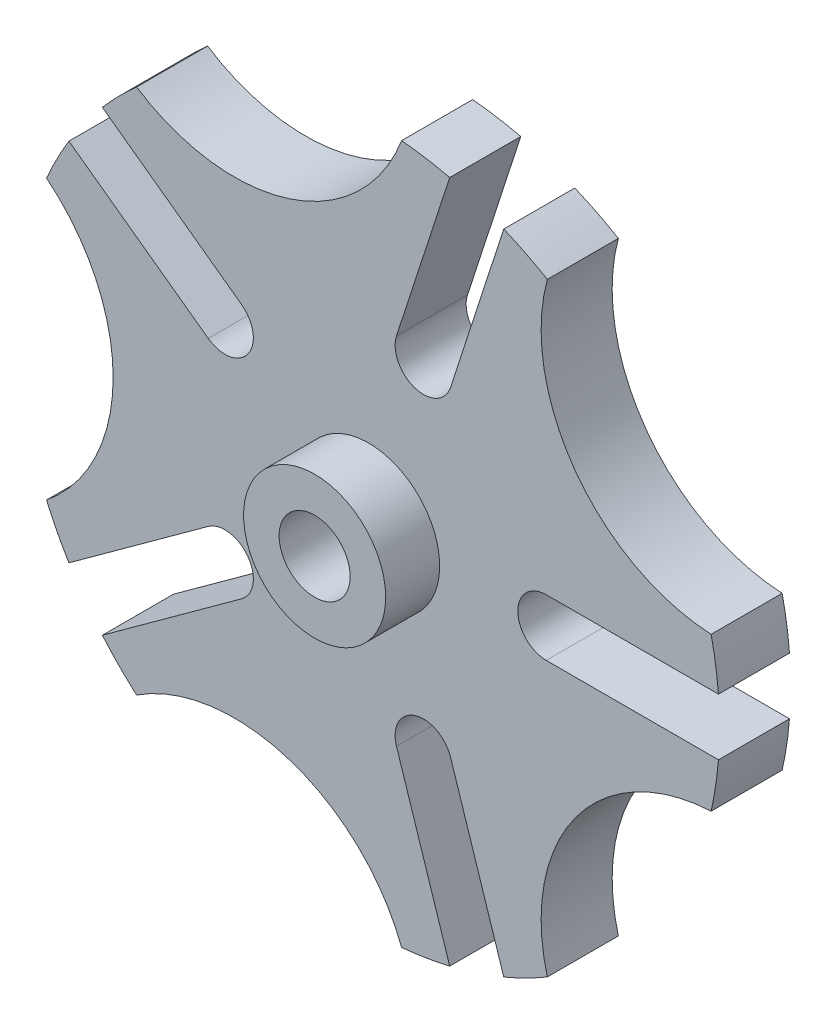
ISO-10303-21;
HEADER;
FILE_DESCRIPTION(('STEP AP214'),'2;1');
FILE_NAME('part.step','',(''),(''),'','','');
FILE_SCHEMA(('AUTOMOTIVE_DESIGN { 1 0 10303 214 1 1 1 1 }'));
ENDSEC;
DATA;
#1=APPLICATION_CONTEXT('core data for automotive mechanical design processes');
#2=APPLICATION_PROTOCOL_DEFINITION('international standard','automotive_design',2000,#1);
#3=PRODUCT_CONTEXT('',#1,'mechanical');
#4=PRODUCT('Part','Part','',(#3));
#5=PRODUCT_RELATED_PRODUCT_CATEGORY('part','',(#4));
#6=PRODUCT_DEFINITION_FORMATION('','',#4);
#7=PRODUCT_DEFINITION_CONTEXT('part definition',#1,'design');
#8=PRODUCT_DEFINITION('design','',#6,#7);
#9=PRODUCT_DEFINITION_SHAPE('','',#8);
#10=(LENGTH_UNIT() NAMED_UNIT(*) SI_UNIT(.MILLI.,.METRE.));
#11=(NAMED_UNIT(*) PLANE_ANGLE_UNIT() SI_UNIT($,.RADIAN.));
#12=(NAMED_UNIT(*) SI_UNIT($,.STERADIAN.) SOLID_ANGLE_UNIT());
#13=UNCERTAINTY_MEASURE_WITH_UNIT(LENGTH_MEASURE(1.E-05),#10,'distance_accuracy_value','');
#14=(GEOMETRIC_REPRESENTATION_CONTEXT(3) GLOBAL_UNCERTAINTY_ASSIGNED_CONTEXT((#13)) GLOBAL_UNIT_ASSIGNED_CONTEXT((#10,
#11,#12)) REPRESENTATION_CONTEXT('',''));
#15=CARTESIAN_POINT('',(0.,0.,0.));
#16=DIRECTION('',(0.,0.,1.));
#17=DIRECTION('',(1.,0.,0.));
#18=AXIS2_PLACEMENT_3D('',#15,#16,#17);
#19=CARTESIAN_POINT('',(15.875,0.,6.35));
#20=DIRECTION('',(0.,0.,-1.));
#21=DIRECTION('',(-1.,0.,0.));
#22=AXIS2_PLACEMENT_3D('',#19,#20,#21);
#23=CYLINDRICAL_SURFACE('',#22,2.54);
#24=CARTESIAN_POINT('',(15.875,0.,0.));
#25=DIRECTION('',(0.,0.,-1.));
#26=DIRECTION('',(1.,0.,0.));
#27=AXIS2_PLACEMENT_3D('',#24,#25,#26);
#28=CIRCLE('',#27,2.54);
#29=CARTESIAN_POINT('',(15.875,-2.53999999999989,0.));
#30=VERTEX_POINT('',#29);
#31=CARTESIAN_POINT('',(15.875,2.54,0.));
#32=VERTEX_POINT('',#31);
#33=EDGE_CURVE('E135',#30,#32,#28,.T.);
#34=ORIENTED_EDGE('',*,*,#33,.T.);
#35=DIRECTION('',(0.,0.,-1.));
#36=VECTOR('',#35,1.);
#37=CARTESIAN_POINT('',(15.875,2.54,6.35));
#38=LINE('',#37,#36);
#39=CARTESIAN_POINT('',(15.875,2.54,6.35));
#40=VERTEX_POINT('',#39);
#41=EDGE_CURVE('E46',#40,#32,#38,.T.);
#42=ORIENTED_EDGE('',*,*,#41,.F.);
#43=CARTESIAN_POINT('',(15.875,0.,6.35));
#44=DIRECTION('',(0.,0.,-1.));
#45=DIRECTION('',(1.,0.,0.));
#46=AXIS2_PLACEMENT_3D('',#43,#44,#45);
#47=CIRCLE('',#46,2.54);
#48=CARTESIAN_POINT('',(15.875,-2.53999999999989,6.35));
#49=VERTEX_POINT('',#48);
#50=EDGE_CURVE('E98',#49,#40,#47,.T.);
#51=ORIENTED_EDGE('',*,*,#50,.F.);
#52=DIRECTION('',(0.,0.,-1.));
#53=VECTOR('',#52,1.);
#54=CARTESIAN_POINT('',(15.875,-2.53999999999989,6.35));
#55=LINE('',#54,#53);
#56=EDGE_CURVE('E348',#49,#30,#55,.T.);
#57=ORIENTED_EDGE('',*,*,#56,.T.);
#58=EDGE_LOOP('',(#34,#42,#51,#57));
#59=FACE_BOUND('',#58,.T.);
#60=ADVANCED_FACE('F43',(#59),#23,.F.);
#61=CARTESIAN_POINT('',(15.875,2.54,6.35));
#62=DIRECTION('',(0.,1.,0.));
#63=DIRECTION('',(0.,0.,1.));
#64=AXIS2_PLACEMENT_3D('',#61,#62,#63);
#65=PLANE('',#64);
#66=DIRECTION('',(1.,0.,0.));
#67=VECTOR('',#66,1.);
#68=CARTESIAN_POINT('',(15.875,2.54,0.));
#69=LINE('',#68,#67);
#70=CARTESIAN_POINT('',(31.2659968815965,2.54,0.));
#71=VERTEX_POINT('',#70);
#72=EDGE_CURVE('E137',#32,#71,#69,.T.);
#73=ORIENTED_EDGE('',*,*,#72,.T.);
#74=DIRECTION('',(0.,0.,-1.));
#75=VECTOR('',#74,1.);
#76=CARTESIAN_POINT('',(31.2659968815965,2.54,6.35));
#77=LINE('',#76,#75);
#78=CARTESIAN_POINT('',(31.2659968815965,2.54,6.35));
#79=VERTEX_POINT('',#78);
#80=EDGE_CURVE('E150',#79,#71,#77,.T.);
#81=ORIENTED_EDGE('',*,*,#80,.F.);
#82=DIRECTION('',(1.,0.,0.));
#83=VECTOR('',#82,1.);
#84=CARTESIAN_POINT('',(15.875,2.54,6.35));
#85=LINE('',#84,#83);
#86=EDGE_CURVE('E160',#40,#79,#85,.T.);
#87=ORIENTED_EDGE('',*,*,#86,.F.);
#88=ORIENTED_EDGE('',*,*,#41,.T.);
#89=EDGE_LOOP('',(#73,#81,#87,#88));
#90=FACE_BOUND('',#89,.T.);
#91=ADVANCED_FACE('F159',(#90),#65,.F.);
#92=CARTESIAN_POINT('',(0.,0.,6.35));
#93=DIRECTION('',(0.,0.,-1.));
#94=DIRECTION('',(-1.,0.,0.));
#95=AXIS2_PLACEMENT_3D('',#92,#93,#94);
#96=CYLINDRICAL_SURFACE('',#95,31.369);
#97=CARTESIAN_POINT('',(0.,0.,0.));
#98=DIRECTION('',(0.,0.,1.));
#99=DIRECTION('',(1.,0.,0.));
#100=AXIS2_PLACEMENT_3D('',#97,#98,#99);
#101=CIRCLE('',#100,31.369);
#102=CARTESIAN_POINT('',(30.6128649977918,6.8459227009201,0.));
#103=VERTEX_POINT('',#102);
#104=EDGE_CURVE('E140',#71,#103,#101,.T.);
#105=ORIENTED_EDGE('',*,*,#104,.T.);
#106=DIRECTION('',(0.,0.,-1.));
#107=VECTOR('',#106,1.);
#108=CARTESIAN_POINT('',(30.6128649977918,6.8459227009201,6.35));
#109=LINE('',#108,#107);
#110=CARTESIAN_POINT('',(30.6128649977918,6.8459227009201,6.35));
#111=VERTEX_POINT('',#110);
#112=EDGE_CURVE('E124',#111,#103,#109,.T.);
#113=ORIENTED_EDGE('',*,*,#112,.F.);
#114=CARTESIAN_POINT('',(0.,0.,6.35));
#115=DIRECTION('',(0.,0.,1.));
#116=DIRECTION('',(1.,0.,0.));
#117=AXIS2_PLACEMENT_3D('',#114,#115,#116);
#118=CIRCLE('',#117,31.369);
#119=EDGE_CURVE('E115',#79,#111,#118,.T.);
#120=ORIENTED_EDGE('',*,*,#119,.F.);
#121=ORIENTED_EDGE('',*,*,#80,.T.);
#122=EDGE_LOOP('',(#105,#113,#120,#121));
#123=FACE_BOUND('',#122,.T.);
#124=ADVANCED_FACE('F168',(#123),#96,.T.);
#125=CARTESIAN_POINT('',(31.4194694037421,22.8275807291818,6.35));
#126=DIRECTION('',(0.,0.,-1.));
#127=DIRECTION('',(-1.,0.,0.));
#128=AXIS2_PLACEMENT_3D('',#125,#126,#127);
#129=CYLINDRICAL_SURFACE('',#128,16.002);
#130=CARTESIAN_POINT('',(31.4194694037421,22.8275807291818,0.));
#131=DIRECTION('',(0.,0.,-1.));
#132=DIRECTION('',(1.,0.,0.));
#133=AXIS2_PLACEMENT_3D('',#130,#131,#132);
#134=CIRCLE('',#133,16.002);
#135=CARTESIAN_POINT('',(15.9707549255868,26.9990582818521,0.));
#136=VERTEX_POINT('',#135);
#137=EDGE_CURVE('E123',#103,#136,#134,.T.);
#138=ORIENTED_EDGE('',*,*,#137,.T.);
#139=DIRECTION('',(0.,0.,-1.));
#140=VECTOR('',#139,1.);
#141=CARTESIAN_POINT('',(15.9707549255868,26.9990582818521,6.35));
#142=LINE('',#141,#140);
#143=CARTESIAN_POINT('',(15.9707549255868,26.9990582818521,6.35));
#144=VERTEX_POINT('',#143);
#145=EDGE_CURVE('E120',#144,#136,#142,.T.);
#146=ORIENTED_EDGE('',*,*,#145,.F.);
#147=CARTESIAN_POINT('',(31.4194694037421,22.8275807291818,6.35));
#148=DIRECTION('',(0.,0.,-1.));
#149=DIRECTION('',(1.,0.,0.));
#150=AXIS2_PLACEMENT_3D('',#147,#148,#149);
#151=CIRCLE('',#150,16.002);
#152=EDGE_CURVE('E109',#111,#144,#151,.T.);
#153=ORIENTED_EDGE('',*,*,#152,.F.);
#154=ORIENTED_EDGE('',*,*,#112,.T.);
#155=EDGE_LOOP('',(#138,#146,#153,#154));
#156=FACE_BOUND('',#155,.T.);
#157=ADVANCED_FACE('F121',(#156),#129,.F.);
#158=CARTESIAN_POINT('',(0.,0.,6.35));
#159=DIRECTION('',(0.,0.,-1.));
#160=DIRECTION('',(-1.,0.,0.));
#161=AXIS2_PLACEMENT_3D('',#158,#159,#160);
#162=CYLINDRICAL_SURFACE('',#161,31.369);
#163=CARTESIAN_POINT('',(0.,0.,0.));
#164=DIRECTION('',(0.,0.,1.));
#165=DIRECTION('',(1.,0.,0.));
#166=AXIS2_PLACEMENT_3D('',#163,#164,#165);
#167=CIRCLE('',#166,31.369);
#168=CARTESIAN_POINT('',(12.0774079338772,28.9508269069938,0.));
#169=VERTEX_POINT('',#168);
#170=EDGE_CURVE('E84',#136,#169,#167,.T.);
#171=ORIENTED_EDGE('',*,*,#170,.T.);
#172=DIRECTION('',(0.,0.,-1.));
#173=VECTOR('',#172,1.);
#174=CARTESIAN_POINT('',(12.0774079338772,28.9508269069938,6.35));
#175=LINE('',#174,#173);
#176=CARTESIAN_POINT('',(12.0774079338772,28.9508269069938,6.35));
#177=VERTEX_POINT('',#176);
#178=EDGE_CURVE('E125',#177,#169,#175,.T.);
#179=ORIENTED_EDGE('',*,*,#178,.F.);
#180=CARTESIAN_POINT('',(0.,0.,6.35));
#181=DIRECTION('',(0.,0.,1.));
#182=DIRECTION('',(1.,0.,0.));
#183=AXIS2_PLACEMENT_3D('',#180,#181,#182);
#184=CIRCLE('',#183,31.369);
#185=EDGE_CURVE('E113',#144,#177,#184,.T.);
#186=ORIENTED_EDGE('',*,*,#185,.F.);
#187=ORIENTED_EDGE('',*,*,#145,.T.);
#188=EDGE_LOOP('',(#171,#179,#186,#187));
#189=FACE_BOUND('',#188,.T.);
#190=ADVANCED_FACE('F127',(#189),#162,.T.);
#191=CARTESIAN_POINT('',(7.32132833709204,14.3131190304732,6.35));
#192=DIRECTION('',(0.951056516295152,-0.309016994374951,0.));
#193=DIRECTION('',(0.309016994374951,0.951056516295153,0.));
#194=AXIS2_PLACEMENT_3D('',#191,#192,#193);
#195=PLANE('',#194);
#196=DIRECTION('',(-0.309016994374951,-0.951056516295152,0.));
#197=VECTOR('',#196,1.);
#198=CARTESIAN_POINT('',(7.32132833709204,14.3131190304732,0.));
#199=LINE('',#198,#197);
#200=CARTESIAN_POINT('',(7.32132833709204,14.3131190304732,0.));
#201=VERTEX_POINT('',#200);
#202=EDGE_CURVE('E90',#169,#201,#199,.T.);
#203=ORIENTED_EDGE('',*,*,#202,.T.);
#204=DIRECTION('',(0.,0.,-1.));
#205=VECTOR('',#204,1.);
#206=CARTESIAN_POINT('',(7.32132833709204,14.3131190304732,6.35));
#207=LINE('',#206,#205);
#208=CARTESIAN_POINT('',(7.32132833709204,14.3131190304732,6.35));
#209=VERTEX_POINT('',#208);
#210=EDGE_CURVE('E134',#209,#201,#207,.T.);
#211=ORIENTED_EDGE('',*,*,#210,.F.);
#212=DIRECTION('',(-0.309016994374951,-0.951056516295152,0.));
#213=VECTOR('',#212,1.);
#214=CARTESIAN_POINT('',(7.32132833709204,14.3131190304732,6.35));
#215=LINE('',#214,#213);
#216=EDGE_CURVE('E60',#177,#209,#215,.T.);
#217=ORIENTED_EDGE('',*,*,#216,.F.);
#218=ORIENTED_EDGE('',*,*,#178,.T.);
#219=EDGE_LOOP('',(#203,#211,#217,#218));
#220=FACE_BOUND('',#219,.T.);
#221=ADVANCED_FACE('F414',(#220),#195,.F.);
#222=CARTESIAN_POINT('',(4.90564478570235,15.0980221961855,6.35));
#223=DIRECTION('',(0.,0.,-1.));
#224=DIRECTION('',(-1.,0.,0.));
#225=AXIS2_PLACEMENT_3D('',#222,#223,#224);
#226=CYLINDRICAL_SURFACE('',#225,2.54);
#227=CARTESIAN_POINT('',(4.90564478570235,15.0980221961855,0.));
#228=DIRECTION('',(0.,0.,-1.));
#229=DIRECTION('',(1.,0.,0.));
#230=AXIS2_PLACEMENT_3D('',#227,#228,#229);
#231=CIRCLE('',#230,2.54);
#232=CARTESIAN_POINT('',(2.48996123431256,15.8829253618979,0.));
#233=VERTEX_POINT('',#232);
#234=EDGE_CURVE('E145',#201,#233,#231,.T.);
#235=ORIENTED_EDGE('',*,*,#234,.T.);
#236=DIRECTION('',(0.,0.,-1.));
#237=VECTOR('',#236,1.);
#238=CARTESIAN_POINT('',(2.48996123431256,15.8829253618979,6.35));
#239=LINE('',#238,#237);
#240=CARTESIAN_POINT('',(2.48996123431256,15.8829253618979,6.35));
#241=VERTEX_POINT('',#240);
#242=EDGE_CURVE('E138',#241,#233,#239,.T.);
#243=ORIENTED_EDGE('',*,*,#242,.F.);
#244=CARTESIAN_POINT('',(4.90564478570235,15.0980221961855,6.35));
#245=DIRECTION('',(0.,0.,-1.));
#246=DIRECTION('',(1.,0.,0.));
#247=AXIS2_PLACEMENT_3D('',#244,#245,#246);
#248=CIRCLE('',#247,2.54);
#249=EDGE_CURVE('E129',#209,#241,#248,.T.);
#250=ORIENTED_EDGE('',*,*,#249,.F.);
#251=ORIENTED_EDGE('',*,*,#210,.T.);
#252=EDGE_LOOP('',(#235,#243,#250,#251));
#253=FACE_BOUND('',#252,.T.);
#254=ADVANCED_FACE('F405',(#253),#226,.F.);
#255=CARTESIAN_POINT('',(15.875,0.,6.35));
#256=DIRECTION('',(0.,0.,1.));
#257=DIRECTION('',(1.,0.,0.));
#258=AXIS2_PLACEMENT_3D('',#255,#256,#257);
#259=PLANE('',#258);
#260=CARTESIAN_POINT('',(0.,0.,6.35));
#261=DIRECTION('',(0.,0.,1.));
#262=DIRECTION('',(1.,0.,0.));
#263=AXIS2_PLACEMENT_3D('',#260,#261,#262);
#264=CIRCLE('',#263,6.35);
#265=CARTESIAN_POINT('',(6.35,0.,6.35));
#266=VERTEX_POINT('',#265);
#267=EDGE_CURVE('E11',#266,#266,#264,.T.);
#268=ORIENTED_EDGE('',*,*,#267,.F.);
#269=EDGE_LOOP('',(#268));
#270=FACE_BOUND('',#269,.T.);
#271=ORIENTED_EDGE('',*,*,#249,.T.);
#272=DIRECTION('',(0.309016994374945,0.951056516295155,0.));
#273=VECTOR('',#272,1.);
#274=CARTESIAN_POINT('',(2.48996123431256,15.8829253618979,6.35));
#275=LINE('',#274,#273);
#276=CARTESIAN_POINT('',(7.24604083109764,30.5206332384187,6.35));
#277=VERTEX_POINT('',#276);
#278=EDGE_CURVE('E193',#241,#277,#275,.T.);
#279=ORIENTED_EDGE('',*,*,#278,.T.);
#280=CARTESIAN_POINT('',(0.,0.,6.35));
#281=DIRECTION('',(0.,0.,1.));
#282=DIRECTION('',(0.309016994374945,0.951056516295155,0.));
#283=AXIS2_PLACEMENT_3D('',#280,#281,#282);
#284=CIRCLE('',#283,31.369);
#285=CARTESIAN_POINT('',(2.94903613606059,31.2300711953753,6.35));
#286=VERTEX_POINT('',#285);
#287=EDGE_CURVE('E221',#277,#286,#284,.T.);
#288=ORIENTED_EDGE('',*,*,#287,.T.);
#289=CARTESIAN_POINT('',(-12.0011694037421,36.9358015007484,6.35));
#290=DIRECTION('',(0.,0.,-1.));
#291=DIRECTION('',(0.309016994374945,0.951056516295155,0.));
#292=AXIS2_PLACEMENT_3D('',#289,#290,#291);
#293=CIRCLE('',#292,16.002);
#294=CARTESIAN_POINT('',(-20.7423956277844,23.5322583833441,6.35));
#295=VERTEX_POINT('',#294);
#296=EDGE_CURVE('E218',#286,#295,#293,.T.);
#297=ORIENTED_EDGE('',*,*,#296,.T.);
#298=CARTESIAN_POINT('',(0.,0.,6.35));
#299=DIRECTION('',(0.,0.,1.));
#300=DIRECTION('',(0.309016994374945,0.951056516295155,0.));
#301=AXIS2_PLACEMENT_3D('',#298,#299,#300);
#302=CIRCLE('',#301,31.369);
#303=CARTESIAN_POINT('',(-23.8017482824627,20.4325950309373,6.35));
#304=VERTEX_POINT('',#303);
#305=EDGE_CURVE('E215',#295,#304,#302,.T.);
#306=ORIENTED_EDGE('',*,*,#305,.T.);
#307=DIRECTION('',(0.809016994374947,-0.587785252292474,0.));
#308=VECTOR('',#307,1.);
#309=CARTESIAN_POINT('',(-11.3501702448794,11.3859940458554,6.35));
#310=LINE('',#309,#308);
#311=CARTESIAN_POINT('',(-11.3501702448794,11.3859940458554,6.35));
#312=VERTEX_POINT('',#311);
#313=EDGE_CURVE('E212',#304,#312,#310,.T.);
#314=ORIENTED_EDGE('',*,*,#313,.T.);
#315=CARTESIAN_POINT('',(-12.8431447857023,9.33109088014303,6.35));
#316=DIRECTION('',(0.,0.,-1.));
#317=DIRECTION('',(0.309016994374945,0.951056516295155,0.));
#318=AXIS2_PLACEMENT_3D('',#315,#316,#317);
#319=CIRCLE('',#318,2.54);
#320=CARTESIAN_POINT('',(-14.3361193265252,7.27618771443056,6.35));
#321=VERTEX_POINT('',#320);
#322=EDGE_CURVE('E189',#312,#321,#319,.T.);
#323=ORIENTED_EDGE('',*,*,#322,.T.);
#324=DIRECTION('',(-0.809016994374951,0.587785252292468,0.));
#325=VECTOR('',#324,1.);
#326=CARTESIAN_POINT('',(-14.3361193265252,7.27618771443056,6.35));
#327=LINE('',#326,#325);
#328=CARTESIAN_POINT('',(-26.7876973641086,16.3227886995123,6.35));
#329=VERTEX_POINT('',#328);
#330=EDGE_CURVE('E247',#321,#329,#327,.T.);
#331=ORIENTED_EDGE('',*,*,#330,.T.);
#332=CARTESIAN_POINT('',(0.,0.,6.35));
#333=DIRECTION('',(0.,0.,1.));
#334=DIRECTION('',(-0.809016994374951,0.587785252292469,0.));
#335=AXIS2_PLACEMENT_3D('',#332,#333,#334);
#336=CIRCLE('',#335,31.369);
#337=CARTESIAN_POINT('',(-28.7902604316547,12.4553227689007,6.35));
#338=VERTEX_POINT('',#337);
#339=EDGE_CURVE('E275',#329,#338,#336,.T.);
#340=ORIENTED_EDGE('',*,*,#339,.T.);
#341=CARTESIAN_POINT('',(-38.8366,-1.31838984174237E-13,6.35));
#342=DIRECTION('',(0.,0.,-1.));
#343=DIRECTION('',(-0.809016994374951,0.587785252292469,0.));
#344=AXIS2_PLACEMENT_3D('',#341,#342,#343);
#345=CIRCLE('',#344,16.002);
#346=CARTESIAN_POINT('',(-28.7902604316546,-12.4553227689009,6.35));
#347=VERTEX_POINT('',#346);
#348=EDGE_CURVE('E272',#338,#347,#345,.T.);
#349=ORIENTED_EDGE('',*,*,#348,.T.);
#350=CARTESIAN_POINT('',(0.,0.,6.35));
#351=DIRECTION('',(0.,0.,1.));
#352=DIRECTION('',(-0.809016994374951,0.587785252292469,0.));
#353=AXIS2_PLACEMENT_3D('',#350,#351,#352);
#354=CIRCLE('',#353,31.369);
#355=CARTESIAN_POINT('',(-26.7876973641085,-16.3227886995125,6.35));
#356=VERTEX_POINT('',#355);
#357=EDGE_CURVE('E269',#347,#356,#354,.T.);
#358=ORIENTED_EDGE('',*,*,#357,.T.);
#359=DIRECTION('',(0.809016994374946,0.587785252292474,0.));
#360=VECTOR('',#359,1.);
#361=CARTESIAN_POINT('',(-14.3361193265252,-7.27618771443066,6.35));
#362=LINE('',#361,#360);
#363=CARTESIAN_POINT('',(-14.3361193265252,-7.27618771443067,6.35));
#364=VERTEX_POINT('',#363);
#365=EDGE_CURVE('E266',#356,#364,#362,.T.);
#366=ORIENTED_EDGE('',*,*,#365,.T.);
#367=CARTESIAN_POINT('',(-12.8431447857023,-9.33109088014303,6.35));
#368=DIRECTION('',(0.,0.,-1.));
#369=DIRECTION('',(-0.809016994374951,0.587785252292469,0.));
#370=AXIS2_PLACEMENT_3D('',#367,#368,#369);
#371=CIRCLE('',#370,2.54);
#372=CARTESIAN_POINT('',(-11.3501702448793,-11.3859940458555,6.35));
#373=VERTEX_POINT('',#372);
#374=EDGE_CURVE('E243',#364,#373,#371,.T.);
#375=ORIENTED_EDGE('',*,*,#374,.T.);
#376=DIRECTION('',(-0.809016994374942,-0.58778525229248,0.));
#377=VECTOR('',#376,1.);
#378=CARTESIAN_POINT('',(-11.3501702448793,-11.3859940458555,6.35));
#379=LINE('',#378,#377);
#380=CARTESIAN_POINT('',(-23.8017482824626,-20.4325950309374,6.35));
#381=VERTEX_POINT('',#380);
#382=EDGE_CURVE('E301',#373,#381,#379,.T.);
#383=ORIENTED_EDGE('',*,*,#382,.T.);
#384=CARTESIAN_POINT('',(0.,0.,6.35));
#385=DIRECTION('',(0.,0.,1.));
#386=DIRECTION('',(-0.809016994374942,-0.58778525229248,0.));
#387=AXIS2_PLACEMENT_3D('',#384,#385,#386);
#388=CIRCLE('',#387,31.369);
#389=CARTESIAN_POINT('',(-20.7423956277843,-23.5322583833443,6.35));
#390=VERTEX_POINT('',#389);
#391=EDGE_CURVE('E329',#381,#390,#388,.T.);
#392=ORIENTED_EDGE('',*,*,#391,.T.);
#393=CARTESIAN_POINT('',(-12.0011694037418,-36.9358015007484,6.35));
#394=DIRECTION('',(0.,0.,-1.));
#395=DIRECTION('',(-0.809016994374942,-0.58778525229248,0.));
#396=AXIS2_PLACEMENT_3D('',#393,#394,#395);
#397=CIRCLE('',#396,16.002);
#398=CARTESIAN_POINT('',(2.94903613606081,-31.2300711953753,6.35));
#399=VERTEX_POINT('',#398);
#400=EDGE_CURVE('E326',#390,#399,#397,.T.);
#401=ORIENTED_EDGE('',*,*,#400,.T.);
#402=CARTESIAN_POINT('',(0.,0.,6.35));
#403=DIRECTION('',(0.,0.,1.));
#404=DIRECTION('',(-0.809016994374942,-0.58778525229248,0.));
#405=AXIS2_PLACEMENT_3D('',#402,#403,#404);
#406=CIRCLE('',#405,31.369);
#407=CARTESIAN_POINT('',(7.24604083109787,-30.5206332384186,6.35));
#408=VERTEX_POINT('',#407);
#409=EDGE_CURVE('E323',#399,#408,#406,.T.);
#410=ORIENTED_EDGE('',*,*,#409,.T.);
#411=DIRECTION('',(-0.309016994374952,0.951056516295152,0.));
#412=VECTOR('',#411,1.);
#413=CARTESIAN_POINT('',(2.48996123431267,-15.8829253618979,6.35));
#414=LINE('',#413,#412);
#415=CARTESIAN_POINT('',(2.48996123431267,-15.8829253618979,6.35));
#416=VERTEX_POINT('',#415);
#417=EDGE_CURVE('E320',#408,#416,#414,.T.);
#418=ORIENTED_EDGE('',*,*,#417,.T.);
#419=CARTESIAN_POINT('',(4.90564478570236,-15.0980221961855,6.35));
#420=DIRECTION('',(0.,0.,-1.));
#421=DIRECTION('',(-0.809016994374942,-0.58778525229248,0.));
#422=AXIS2_PLACEMENT_3D('',#419,#420,#421);
#423=CIRCLE('',#422,2.54);
#424=CARTESIAN_POINT('',(7.32132833709214,-14.3131190304731,6.35));
#425=VERTEX_POINT('',#424);
#426=EDGE_CURVE('E297',#416,#425,#423,.T.);
#427=ORIENTED_EDGE('',*,*,#426,.T.);
#428=DIRECTION('',(0.309016994374958,-0.95105651629515,0.));
#429=VECTOR('',#428,1.);
#430=CARTESIAN_POINT('',(7.32132833709214,-14.3131190304731,6.35));
#431=LINE('',#430,#429);
#432=CARTESIAN_POINT('',(12.0774079338774,-28.9508269069938,6.35));
#433=VERTEX_POINT('',#432);
#434=EDGE_CURVE('E354',#425,#433,#431,.T.);
#435=ORIENTED_EDGE('',*,*,#434,.T.);
#436=CARTESIAN_POINT('',(0.,0.,6.35));
#437=DIRECTION('',(0.,0.,1.));
#438=DIRECTION('',(0.309016994374958,-0.95105651629515,0.));
#439=AXIS2_PLACEMENT_3D('',#436,#437,#438);
#440=CIRCLE('',#439,31.369);
#441=CARTESIAN_POINT('',(15.9707549255869,-26.999058281852,6.35));
#442=VERTEX_POINT('',#441);
#443=EDGE_CURVE('E375',#433,#442,#440,.T.);
#444=ORIENTED_EDGE('',*,*,#443,.T.);
#445=CARTESIAN_POINT('',(31.4194694037423,-22.8275807291816,6.35));
#446=DIRECTION('',(0.,0.,-1.));
#447=DIRECTION('',(0.309016994374958,-0.95105651629515,0.));
#448=AXIS2_PLACEMENT_3D('',#445,#446,#447);
#449=CIRCLE('',#448,16.002);
#450=CARTESIAN_POINT('',(30.6128649977919,-6.84592270091989,6.35));
#451=VERTEX_POINT('',#450);
#452=EDGE_CURVE('E372',#442,#451,#449,.T.);
#453=ORIENTED_EDGE('',*,*,#452,.T.);
#454=CARTESIAN_POINT('',(0.,0.,6.35));
#455=DIRECTION('',(0.,0.,1.));
#456=DIRECTION('',(0.309016994374958,-0.95105651629515,0.));
#457=AXIS2_PLACEMENT_3D('',#454,#455,#456);
#458=CIRCLE('',#457,31.369);
#459=CARTESIAN_POINT('',(31.2659968815965,-2.53999999999977,6.35));
#460=VERTEX_POINT('',#459);
#461=EDGE_CURVE('E369',#451,#460,#458,.T.);
#462=ORIENTED_EDGE('',*,*,#461,.T.);
#463=DIRECTION('',(-1.,0.,0.));
#464=VECTOR('',#463,1.);
#465=CARTESIAN_POINT('',(15.875,-2.53999999999989,6.35));
#466=LINE('',#465,#464);
#467=EDGE_CURVE('E351',#460,#49,#466,.T.);
#468=ORIENTED_EDGE('',*,*,#467,.T.);
#469=ORIENTED_EDGE('',*,*,#50,.T.);
#470=ORIENTED_EDGE('',*,*,#86,.T.);
#471=ORIENTED_EDGE('',*,*,#119,.T.);
#472=ORIENTED_EDGE('',*,*,#152,.T.);
#473=ORIENTED_EDGE('',*,*,#185,.T.);
#474=ORIENTED_EDGE('',*,*,#216,.T.);
#475=EDGE_LOOP('',(#271,#279,#288,#297,#306,#314,#323,#331,#340,#349,#358,#366,#375,#383,#392,
#401,#410,#418,#427,#435,#444,#453,#462,#468,#469,#470,#471,#472,#473,#474));
#476=FACE_BOUND('',#475,.T.);
#477=ADVANCED_FACE('F111',(#270,#476),#259,.T.);
#478=CARTESIAN_POINT('',(15.875,0.,0.));
#479=DIRECTION('',(0.,0.,1.));
#480=DIRECTION('',(1.,0.,0.));
#481=AXIS2_PLACEMENT_3D('',#478,#479,#480);
#482=PLANE('',#481);
#483=CARTESIAN_POINT('',(0.,0.,0.));
#484=DIRECTION('',(0.,0.,1.));
#485=DIRECTION('',(1.,0.,0.));
#486=AXIS2_PLACEMENT_3D('',#483,#484,#485);
#487=CIRCLE('',#486,3.17499999999999);
#488=CARTESIAN_POINT('',(3.17499999999999,0.,0.));
#489=VERTEX_POINT('',#488);
#490=EDGE_CURVE('E382',#489,#489,#487,.T.);
#491=ORIENTED_EDGE('',*,*,#490,.T.);
#492=EDGE_LOOP('',(#491));
#493=FACE_BOUND('',#492,.T.);
#494=ORIENTED_EDGE('',*,*,#33,.F.);
#495=DIRECTION('',(-1.,0.,0.));
#496=VECTOR('',#495,1.);
#497=CARTESIAN_POINT('',(15.875,-2.53999999999989,0.));
#498=LINE('',#497,#496);
#499=CARTESIAN_POINT('',(31.2659968815965,-2.53999999999977,0.));
#500=VERTEX_POINT('',#499);
#501=EDGE_CURVE('E352',#500,#30,#498,.T.);
#502=ORIENTED_EDGE('',*,*,#501,.F.);
#503=CARTESIAN_POINT('',(0.,0.,0.));
#504=DIRECTION('',(0.,0.,1.));
#505=DIRECTION('',(0.309016994374958,-0.95105651629515,0.));
#506=AXIS2_PLACEMENT_3D('',#503,#504,#505);
#507=CIRCLE('',#506,31.369);
#508=CARTESIAN_POINT('',(30.6128649977919,-6.84592270091989,0.));
#509=VERTEX_POINT('',#508);
#510=EDGE_CURVE('E355',#509,#500,#507,.T.);
#511=ORIENTED_EDGE('',*,*,#510,.F.);
#512=CARTESIAN_POINT('',(31.4194694037423,-22.8275807291816,0.));
#513=DIRECTION('',(0.,0.,-1.));
#514=DIRECTION('',(0.309016994374958,-0.95105651629515,0.));
#515=AXIS2_PLACEMENT_3D('',#512,#513,#514);
#516=CIRCLE('',#515,16.002);
#517=CARTESIAN_POINT('',(15.9707549255869,-26.999058281852,0.));
#518=VERTEX_POINT('',#517);
#519=EDGE_CURVE('E358',#518,#509,#516,.T.);
#520=ORIENTED_EDGE('',*,*,#519,.F.);
#521=CARTESIAN_POINT('',(0.,0.,0.));
#522=DIRECTION('',(0.,0.,1.));
#523=DIRECTION('',(0.309016994374958,-0.95105651629515,0.));
#524=AXIS2_PLACEMENT_3D('',#521,#522,#523);
#525=CIRCLE('',#524,31.369);
#526=CARTESIAN_POINT('',(12.0774079338774,-28.9508269069938,0.));
#527=VERTEX_POINT('',#526);
#528=EDGE_CURVE('E361',#527,#518,#525,.T.);
#529=ORIENTED_EDGE('',*,*,#528,.F.);
#530=DIRECTION('',(0.309016994374958,-0.95105651629515,0.));
#531=VECTOR('',#530,1.);
#532=CARTESIAN_POINT('',(7.32132833709214,-14.3131190304731,0.));
#533=LINE('',#532,#531);
#534=CARTESIAN_POINT('',(7.32132833709214,-14.3131190304731,0.));
#535=VERTEX_POINT('',#534);
#536=EDGE_CURVE('E364',#535,#527,#533,.T.);
#537=ORIENTED_EDGE('',*,*,#536,.F.);
#538=CARTESIAN_POINT('',(4.90564478570236,-15.0980221961855,0.));
#539=DIRECTION('',(0.,0.,-1.));
#540=DIRECTION('',(-0.809016994374942,-0.58778525229248,0.));
#541=AXIS2_PLACEMENT_3D('',#538,#539,#540);
#542=CIRCLE('',#541,2.54);
#543=CARTESIAN_POINT('',(2.48996123431267,-15.8829253618979,0.));
#544=VERTEX_POINT('',#543);
#545=EDGE_CURVE('E298',#544,#535,#542,.T.);
#546=ORIENTED_EDGE('',*,*,#545,.F.);
#547=DIRECTION('',(-0.309016994374952,0.951056516295152,0.));
#548=VECTOR('',#547,1.);
#549=CARTESIAN_POINT('',(2.48996123431267,-15.8829253618979,0.));
#550=LINE('',#549,#548);
#551=CARTESIAN_POINT('',(7.24604083109787,-30.5206332384186,0.));
#552=VERTEX_POINT('',#551);
#553=EDGE_CURVE('E302',#552,#544,#550,.T.);
#554=ORIENTED_EDGE('',*,*,#553,.F.);
#555=CARTESIAN_POINT('',(0.,0.,0.));
#556=DIRECTION('',(0.,0.,1.));
#557=DIRECTION('',(-0.809016994374942,-0.58778525229248,0.));
#558=AXIS2_PLACEMENT_3D('',#555,#556,#557);
#559=CIRCLE('',#558,31.369);
#560=CARTESIAN_POINT('',(2.94903613606081,-31.2300711953753,0.));
#561=VERTEX_POINT('',#560);
#562=EDGE_CURVE('E305',#561,#552,#559,.T.);
#563=ORIENTED_EDGE('',*,*,#562,.F.);
#564=CARTESIAN_POINT('',(-12.0011694037418,-36.9358015007484,0.));
#565=DIRECTION('',(0.,0.,-1.));
#566=DIRECTION('',(-0.809016994374942,-0.58778525229248,0.));
#567=AXIS2_PLACEMENT_3D('',#564,#565,#566);
#568=CIRCLE('',#567,16.002);
#569=CARTESIAN_POINT('',(-20.7423956277843,-23.5322583833443,0.));
#570=VERTEX_POINT('',#569);
#571=EDGE_CURVE('E308',#570,#561,#568,.T.);
#572=ORIENTED_EDGE('',*,*,#571,.F.);
#573=CARTESIAN_POINT('',(0.,0.,0.));
#574=DIRECTION('',(0.,0.,1.));
#575=DIRECTION('',(-0.809016994374942,-0.58778525229248,0.));
#576=AXIS2_PLACEMENT_3D('',#573,#574,#575);
#577=CIRCLE('',#576,31.369);
#578=CARTESIAN_POINT('',(-23.8017482824626,-20.4325950309374,0.));
#579=VERTEX_POINT('',#578);
#580=EDGE_CURVE('E311',#579,#570,#577,.T.);
#581=ORIENTED_EDGE('',*,*,#580,.F.);
#582=DIRECTION('',(-0.809016994374942,-0.58778525229248,0.));
#583=VECTOR('',#582,1.);
#584=CARTESIAN_POINT('',(-11.3501702448793,-11.3859940458555,0.));
#585=LINE('',#584,#583);
#586=CARTESIAN_POINT('',(-11.3501702448793,-11.3859940458555,0.));
#587=VERTEX_POINT('',#586);
#588=EDGE_CURVE('E314',#587,#579,#585,.T.);
#589=ORIENTED_EDGE('',*,*,#588,.F.);
#590=CARTESIAN_POINT('',(-12.8431447857023,-9.33109088014303,0.));
#591=DIRECTION('',(0.,0.,-1.));
#592=DIRECTION('',(-0.809016994374951,0.587785252292469,0.));
#593=AXIS2_PLACEMENT_3D('',#590,#591,#592);
#594=CIRCLE('',#593,2.54);
#595=CARTESIAN_POINT('',(-14.3361193265252,-7.27618771443067,0.));
#596=VERTEX_POINT('',#595);
#597=EDGE_CURVE('E244',#596,#587,#594,.T.);
#598=ORIENTED_EDGE('',*,*,#597,.F.);
#599=DIRECTION('',(0.809016994374946,0.587785252292474,0.));
#600=VECTOR('',#599,1.);
#601=CARTESIAN_POINT('',(-14.3361193265252,-7.27618771443066,0.));
#602=LINE('',#601,#600);
#603=CARTESIAN_POINT('',(-26.7876973641085,-16.3227886995125,0.));
#604=VERTEX_POINT('',#603);
#605=EDGE_CURVE('E248',#604,#596,#602,.T.);
#606=ORIENTED_EDGE('',*,*,#605,.F.);
#607=CARTESIAN_POINT('',(0.,0.,0.));
#608=DIRECTION('',(0.,0.,1.));
#609=DIRECTION('',(-0.809016994374951,0.587785252292469,0.));
#610=AXIS2_PLACEMENT_3D('',#607,#608,#609);
#611=CIRCLE('',#610,31.369);
#612=CARTESIAN_POINT('',(-28.7902604316546,-12.4553227689009,0.));
#613=VERTEX_POINT('',#612);
#614=EDGE_CURVE('E251',#613,#604,#611,.T.);
#615=ORIENTED_EDGE('',*,*,#614,.F.);
#616=CARTESIAN_POINT('',(-38.8366,-1.31838984174237E-13,0.));
#617=DIRECTION('',(0.,0.,-1.));
#618=DIRECTION('',(-0.809016994374951,0.587785252292469,0.));
#619=AXIS2_PLACEMENT_3D('',#616,#617,#618);
#620=CIRCLE('',#619,16.002);
#621=CARTESIAN_POINT('',(-28.7902604316547,12.4553227689007,0.));
#622=VERTEX_POINT('',#621);
#623=EDGE_CURVE('E254',#622,#613,#620,.T.);
#624=ORIENTED_EDGE('',*,*,#623,.F.);
#625=CARTESIAN_POINT('',(0.,0.,0.));
#626=DIRECTION('',(0.,0.,1.));
#627=DIRECTION('',(-0.809016994374951,0.587785252292469,0.));
#628=AXIS2_PLACEMENT_3D('',#625,#626,#627);
#629=CIRCLE('',#628,31.369);
#630=CARTESIAN_POINT('',(-26.7876973641086,16.3227886995123,0.));
#631=VERTEX_POINT('',#630);
#632=EDGE_CURVE('E257',#631,#622,#629,.T.);
#633=ORIENTED_EDGE('',*,*,#632,.F.);
#634=DIRECTION('',(-0.809016994374951,0.587785252292468,0.));
#635=VECTOR('',#634,1.);
#636=CARTESIAN_POINT('',(-14.3361193265252,7.27618771443056,0.));
#637=LINE('',#636,#635);
#638=CARTESIAN_POINT('',(-14.3361193265252,7.27618771443056,0.));
#639=VERTEX_POINT('',#638);
#640=EDGE_CURVE('E260',#639,#631,#637,.T.);
#641=ORIENTED_EDGE('',*,*,#640,.F.);
#642=CARTESIAN_POINT('',(-12.8431447857023,9.33109088014303,0.));
#643=DIRECTION('',(0.,0.,-1.));
#644=DIRECTION('',(0.309016994374945,0.951056516295155,0.));
#645=AXIS2_PLACEMENT_3D('',#642,#643,#644);
#646=CIRCLE('',#645,2.54);
#647=CARTESIAN_POINT('',(-11.3501702448794,11.3859940458554,0.));
#648=VERTEX_POINT('',#647);
#649=EDGE_CURVE('E190',#648,#639,#646,.T.);
#650=ORIENTED_EDGE('',*,*,#649,.F.);
#651=DIRECTION('',(0.809016994374947,-0.587785252292474,0.));
#652=VECTOR('',#651,1.);
#653=CARTESIAN_POINT('',(-11.3501702448794,11.3859940458554,0.));
#654=LINE('',#653,#652);
#655=CARTESIAN_POINT('',(-23.8017482824627,20.4325950309373,0.));
#656=VERTEX_POINT('',#655);
#657=EDGE_CURVE('E194',#656,#648,#654,.T.);
#658=ORIENTED_EDGE('',*,*,#657,.F.);
#659=CARTESIAN_POINT('',(0.,0.,0.));
#660=DIRECTION('',(0.,0.,1.));
#661=DIRECTION('',(0.309016994374945,0.951056516295155,0.));
#662=AXIS2_PLACEMENT_3D('',#659,#660,#661);
#663=CIRCLE('',#662,31.369);
#664=CARTESIAN_POINT('',(-20.7423956277844,23.5322583833441,0.));
#665=VERTEX_POINT('',#664);
#666=EDGE_CURVE('E197',#665,#656,#663,.T.);
#667=ORIENTED_EDGE('',*,*,#666,.F.);
#668=CARTESIAN_POINT('',(-12.0011694037421,36.9358015007484,0.));
#669=DIRECTION('',(0.,0.,-1.));
#670=DIRECTION('',(0.309016994374945,0.951056516295155,0.));
#671=AXIS2_PLACEMENT_3D('',#668,#669,#670);
#672=CIRCLE('',#671,16.002);
#673=CARTESIAN_POINT('',(2.94903613606059,31.2300711953753,0.));
#674=VERTEX_POINT('',#673);
#675=EDGE_CURVE('E200',#674,#665,#672,.T.);
#676=ORIENTED_EDGE('',*,*,#675,.F.);
#677=CARTESIAN_POINT('',(0.,0.,0.));
#678=DIRECTION('',(0.,0.,1.));
#679=DIRECTION('',(0.309016994374945,0.951056516295155,0.));
#680=AXIS2_PLACEMENT_3D('',#677,#678,#679);
#681=CIRCLE('',#680,31.369);
#682=CARTESIAN_POINT('',(7.24604083109764,30.5206332384187,0.));
#683=VERTEX_POINT('',#682);
#684=EDGE_CURVE('E203',#683,#674,#681,.T.);
#685=ORIENTED_EDGE('',*,*,#684,.F.);
#686=DIRECTION('',(0.309016994374945,0.951056516295155,0.));
#687=VECTOR('',#686,1.);
#688=CARTESIAN_POINT('',(2.48996123431256,15.8829253618979,0.));
#689=LINE('',#688,#687);
#690=EDGE_CURVE('E206',#233,#683,#689,.T.);
#691=ORIENTED_EDGE('',*,*,#690,.F.);
#692=ORIENTED_EDGE('',*,*,#234,.F.);
#693=ORIENTED_EDGE('',*,*,#202,.F.);
#694=ORIENTED_EDGE('',*,*,#170,.F.);
#695=ORIENTED_EDGE('',*,*,#137,.F.);
#696=ORIENTED_EDGE('',*,*,#104,.F.);
#697=ORIENTED_EDGE('',*,*,#72,.F.);
#698=EDGE_LOOP('',(#494,#502,#511,#520,#529,#537,#546,#554,#563,#572,#581,#589,#598,#606,#615,
#624,#633,#641,#650,#658,#667,#676,#685,#691,#692,#693,#694,#695,#696,#697));
#699=FACE_BOUND('',#698,.T.);
#700=ADVANCED_FACE('F164',(#493,#699),#482,.F.);
#701=CARTESIAN_POINT('',(2.48996123431256,15.8829253618979,6.35));
#702=DIRECTION('',(-0.951056516295154,0.309016994374945,0.));
#703=DIRECTION('',(-0.309016994374945,-0.951056516295155,0.));
#704=AXIS2_PLACEMENT_3D('',#701,#702,#703);
#705=PLANE('',#704);
#706=ORIENTED_EDGE('',*,*,#690,.T.);
#707=DIRECTION('',(0.,0.,-1.));
#708=VECTOR('',#707,1.);
#709=CARTESIAN_POINT('',(7.24604083109764,30.5206332384187,6.35));
#710=LINE('',#709,#708);
#711=EDGE_CURVE('E174',#277,#683,#710,.T.);
#712=ORIENTED_EDGE('',*,*,#711,.F.);
#713=ORIENTED_EDGE('',*,*,#278,.F.);
#714=ORIENTED_EDGE('',*,*,#242,.T.);
#715=EDGE_LOOP('',(#706,#712,#713,#714));
#716=FACE_BOUND('',#715,.T.);
#717=ADVANCED_FACE('F411',(#716),#705,.F.);
#718=CARTESIAN_POINT('',(0.,0.,6.35));
#719=DIRECTION('',(0.,0.,-1.));
#720=DIRECTION('',(-1.,0.,0.));
#721=AXIS2_PLACEMENT_3D('',#718,#719,#720);
#722=CYLINDRICAL_SURFACE('',#721,31.369);
#723=ORIENTED_EDGE('',*,*,#684,.T.);
#724=DIRECTION('',(0.,0.,-1.));
#725=VECTOR('',#724,1.);
#726=CARTESIAN_POINT('',(2.94903613606059,31.2300711953753,6.35));
#727=LINE('',#726,#725);
#728=EDGE_CURVE('E177',#286,#674,#727,.T.);
#729=ORIENTED_EDGE('',*,*,#728,.F.);
#730=ORIENTED_EDGE('',*,*,#287,.F.);
#731=ORIENTED_EDGE('',*,*,#711,.T.);
#732=EDGE_LOOP('',(#723,#729,#730,#731));
#733=FACE_BOUND('',#732,.T.);
#734=ADVANCED_FACE('F549',(#733),#722,.T.);
#735=CARTESIAN_POINT('',(-12.0011694037421,36.9358015007484,6.35));
#736=DIRECTION('',(0.,0.,-1.));
#737=DIRECTION('',(-1.,0.,0.));
#738=AXIS2_PLACEMENT_3D('',#735,#736,#737);
#739=CYLINDRICAL_SURFACE('',#738,16.002);
#740=ORIENTED_EDGE('',*,*,#675,.T.);
#741=DIRECTION('',(0.,0.,-1.));
#742=VECTOR('',#741,1.);
#743=CARTESIAN_POINT('',(-20.7423956277844,23.5322583833441,6.35));
#744=LINE('',#743,#742);
#745=EDGE_CURVE('E180',#295,#665,#744,.T.);
#746=ORIENTED_EDGE('',*,*,#745,.F.);
#747=ORIENTED_EDGE('',*,*,#296,.F.);
#748=ORIENTED_EDGE('',*,*,#728,.T.);
#749=EDGE_LOOP('',(#740,#746,#747,#748));
#750=FACE_BOUND('',#749,.T.);
#751=ADVANCED_FACE('F542',(#750),#739,.F.);
#752=CARTESIAN_POINT('',(0.,0.,6.35));
#753=DIRECTION('',(0.,0.,-1.));
#754=DIRECTION('',(-1.,0.,0.));
#755=AXIS2_PLACEMENT_3D('',#752,#753,#754);
#756=CYLINDRICAL_SURFACE('',#755,31.369);
#757=ORIENTED_EDGE('',*,*,#666,.T.);
#758=DIRECTION('',(0.,0.,-1.));
#759=VECTOR('',#758,1.);
#760=CARTESIAN_POINT('',(-23.8017482824627,20.4325950309373,6.35));
#761=LINE('',#760,#759);
#762=EDGE_CURVE('E183',#304,#656,#761,.T.);
#763=ORIENTED_EDGE('',*,*,#762,.F.);
#764=ORIENTED_EDGE('',*,*,#305,.F.);
#765=ORIENTED_EDGE('',*,*,#745,.T.);
#766=EDGE_LOOP('',(#757,#763,#764,#765));
#767=FACE_BOUND('',#766,.T.);
#768=ADVANCED_FACE('F540',(#767),#756,.T.);
#769=CARTESIAN_POINT('',(-11.3501702448794,11.3859940458554,6.35));
#770=DIRECTION('',(0.587785252292474,0.809016994374947,0.));
#771=DIRECTION('',(-0.809016994374947,0.587785252292474,0.));
#772=AXIS2_PLACEMENT_3D('',#769,#770,#771);
#773=PLANE('',#772);
#774=ORIENTED_EDGE('',*,*,#657,.T.);
#775=DIRECTION('',(0.,0.,-1.));
#776=VECTOR('',#775,1.);
#777=CARTESIAN_POINT('',(-11.3501702448794,11.3859940458554,6.35));
#778=LINE('',#777,#776);
#779=EDGE_CURVE('E186',#312,#648,#778,.T.);
#780=ORIENTED_EDGE('',*,*,#779,.F.);
#781=ORIENTED_EDGE('',*,*,#313,.F.);
#782=ORIENTED_EDGE('',*,*,#762,.T.);
#783=EDGE_LOOP('',(#774,#780,#781,#782));
#784=FACE_BOUND('',#783,.T.);
#785=ADVANCED_FACE('F517',(#784),#773,.F.);
#786=CARTESIAN_POINT('',(-12.8431447857023,9.33109088014303,6.35));
#787=DIRECTION('',(0.,0.,-1.));
#788=DIRECTION('',(-1.,0.,0.));
#789=AXIS2_PLACEMENT_3D('',#786,#787,#788);
#790=CYLINDRICAL_SURFACE('',#789,2.54);
#791=ORIENTED_EDGE('',*,*,#649,.T.);
#792=DIRECTION('',(0.,0.,-1.));
#793=VECTOR('',#792,1.);
#794=CARTESIAN_POINT('',(-14.3361193265252,7.27618771443056,6.35));
#795=LINE('',#794,#793);
#796=EDGE_CURVE('E209',#321,#639,#795,.T.);
#797=ORIENTED_EDGE('',*,*,#796,.F.);
#798=ORIENTED_EDGE('',*,*,#322,.F.);
#799=ORIENTED_EDGE('',*,*,#779,.T.);
#800=EDGE_LOOP('',(#791,#797,#798,#799));
#801=FACE_BOUND('',#800,.T.);
#802=ADVANCED_FACE('F522',(#801),#790,.F.);
#803=CARTESIAN_POINT('',(-14.3361193265252,7.27618771443056,6.35));
#804=DIRECTION('',(-0.587785252292468,-0.809016994374951,0.));
#805=DIRECTION('',(0.809016994374951,-0.587785252292469,0.));
#806=AXIS2_PLACEMENT_3D('',#803,#804,#805);
#807=PLANE('',#806);
#808=ORIENTED_EDGE('',*,*,#640,.T.);
#809=DIRECTION('',(0.,0.,-1.));
#810=VECTOR('',#809,1.);
#811=CARTESIAN_POINT('',(-26.7876973641086,16.3227886995123,6.35));
#812=LINE('',#811,#810);
#813=EDGE_CURVE('E228',#329,#631,#812,.T.);
#814=ORIENTED_EDGE('',*,*,#813,.F.);
#815=ORIENTED_EDGE('',*,*,#330,.F.);
#816=ORIENTED_EDGE('',*,*,#796,.T.);
#817=EDGE_LOOP('',(#808,#814,#815,#816));
#818=FACE_BOUND('',#817,.T.);
#819=ADVANCED_FACE('F529',(#818),#807,.F.);
#820=CARTESIAN_POINT('',(0.,0.,6.35));
#821=DIRECTION('',(0.,0.,-1.));
#822=DIRECTION('',(-1.,0.,0.));
#823=AXIS2_PLACEMENT_3D('',#820,#821,#822);
#824=CYLINDRICAL_SURFACE('',#823,31.369);
#825=ORIENTED_EDGE('',*,*,#632,.T.);
#826=DIRECTION('',(0.,0.,-1.));
#827=VECTOR('',#826,1.);
#828=CARTESIAN_POINT('',(-28.7902604316547,12.4553227689007,6.35));
#829=LINE('',#828,#827);
#830=EDGE_CURVE('E231',#338,#622,#829,.T.);
#831=ORIENTED_EDGE('',*,*,#830,.F.);
#832=ORIENTED_EDGE('',*,*,#339,.F.);
#833=ORIENTED_EDGE('',*,*,#813,.T.);
#834=EDGE_LOOP('',(#825,#831,#832,#833));
#835=FACE_BOUND('',#834,.T.);
#836=ADVANCED_FACE('F533',(#835),#824,.T.);
#837=CARTESIAN_POINT('',(-38.8366,-1.31838984174237E-13,6.35));
#838=DIRECTION('',(0.,0.,-1.));
#839=DIRECTION('',(-1.,0.,0.));
#840=AXIS2_PLACEMENT_3D('',#837,#838,#839);
#841=CYLINDRICAL_SURFACE('',#840,16.002);
#842=ORIENTED_EDGE('',*,*,#623,.T.);
#843=DIRECTION('',(0.,0.,-1.));
#844=VECTOR('',#843,1.);
#845=CARTESIAN_POINT('',(-28.7902604316546,-12.4553227689009,6.35));
#846=LINE('',#845,#844);
#847=EDGE_CURVE('E234',#347,#613,#846,.T.);
#848=ORIENTED_EDGE('',*,*,#847,.F.);
#849=ORIENTED_EDGE('',*,*,#348,.F.);
#850=ORIENTED_EDGE('',*,*,#830,.T.);
#851=EDGE_LOOP('',(#842,#848,#849,#850));
#852=FACE_BOUND('',#851,.T.);
#853=ADVANCED_FACE('F662',(#852),#841,.F.);
#854=CARTESIAN_POINT('',(0.,0.,6.35));
#855=DIRECTION('',(0.,0.,-1.));
#856=DIRECTION('',(-1.,0.,0.));
#857=AXIS2_PLACEMENT_3D('',#854,#855,#856);
#858=CYLINDRICAL_SURFACE('',#857,31.369);
#859=ORIENTED_EDGE('',*,*,#614,.T.);
#860=DIRECTION('',(0.,0.,-1.));
#861=VECTOR('',#860,1.);
#862=CARTESIAN_POINT('',(-26.7876973641085,-16.3227886995125,6.35));
#863=LINE('',#862,#861);
#864=EDGE_CURVE('E237',#356,#604,#863,.T.);
#865=ORIENTED_EDGE('',*,*,#864,.F.);
#866=ORIENTED_EDGE('',*,*,#357,.F.);
#867=ORIENTED_EDGE('',*,*,#847,.T.);
#868=EDGE_LOOP('',(#859,#865,#866,#867));
#869=FACE_BOUND('',#868,.T.);
#870=ADVANCED_FACE('F671',(#869),#858,.T.);
#871=CARTESIAN_POINT('',(-14.3361193265252,-7.27618771443066,6.35));
#872=DIRECTION('',(-0.587785252292474,0.809016994374946,0.));
#873=DIRECTION('',(-0.809016994374947,-0.587785252292475,0.));
#874=AXIS2_PLACEMENT_3D('',#871,#872,#873);
#875=PLANE('',#874);
#876=ORIENTED_EDGE('',*,*,#605,.T.);
#877=DIRECTION('',(0.,0.,-1.));
#878=VECTOR('',#877,1.);
#879=CARTESIAN_POINT('',(-14.3361193265252,-7.27618771443067,6.35));
#880=LINE('',#879,#878);
#881=EDGE_CURVE('E240',#364,#596,#880,.T.);
#882=ORIENTED_EDGE('',*,*,#881,.F.);
#883=ORIENTED_EDGE('',*,*,#365,.F.);
#884=ORIENTED_EDGE('',*,*,#864,.T.);
#885=EDGE_LOOP('',(#876,#882,#883,#884));
#886=FACE_BOUND('',#885,.T.);
#887=ADVANCED_FACE('F681',(#886),#875,.F.);
#888=CARTESIAN_POINT('',(-12.8431447857023,-9.33109088014303,6.35));
#889=DIRECTION('',(0.,0.,-1.));
#890=DIRECTION('',(-1.,0.,0.));
#891=AXIS2_PLACEMENT_3D('',#888,#889,#890);
#892=CYLINDRICAL_SURFACE('',#891,2.54);
#893=ORIENTED_EDGE('',*,*,#597,.T.);
#894=DIRECTION('',(0.,0.,-1.));
#895=VECTOR('',#894,1.);
#896=CARTESIAN_POINT('',(-11.3501702448793,-11.3859940458555,6.35));
#897=LINE('',#896,#895);
#898=EDGE_CURVE('E263',#373,#587,#897,.T.);
#899=ORIENTED_EDGE('',*,*,#898,.F.);
#900=ORIENTED_EDGE('',*,*,#374,.F.);
#901=ORIENTED_EDGE('',*,*,#881,.T.);
#902=EDGE_LOOP('',(#893,#899,#900,#901));
#903=FACE_BOUND('',#902,.T.);
#904=ADVANCED_FACE('F691',(#903),#892,.F.);
#905=CARTESIAN_POINT('',(-11.3501702448793,-11.3859940458555,6.35));
#906=DIRECTION('',(0.58778525229248,-0.809016994374942,0.));
#907=DIRECTION('',(0.809016994374942,0.58778525229248,0.));
#908=AXIS2_PLACEMENT_3D('',#905,#906,#907);
#909=PLANE('',#908);
#910=ORIENTED_EDGE('',*,*,#588,.T.);
#911=DIRECTION('',(0.,0.,-1.));
#912=VECTOR('',#911,1.);
#913=CARTESIAN_POINT('',(-23.8017482824626,-20.4325950309374,6.35));
#914=LINE('',#913,#912);
#915=EDGE_CURVE('E282',#381,#579,#914,.T.);
#916=ORIENTED_EDGE('',*,*,#915,.F.);
#917=ORIENTED_EDGE('',*,*,#382,.F.);
#918=ORIENTED_EDGE('',*,*,#898,.T.);
#919=EDGE_LOOP('',(#910,#916,#917,#918));
#920=FACE_BOUND('',#919,.T.);
#921=ADVANCED_FACE('F702',(#920),#909,.F.);
#922=CARTESIAN_POINT('',(0.,0.,6.35));
#923=DIRECTION('',(0.,0.,-1.));
#924=DIRECTION('',(-1.,0.,0.));
#925=AXIS2_PLACEMENT_3D('',#922,#923,#924);
#926=CYLINDRICAL_SURFACE('',#925,31.369);
#927=ORIENTED_EDGE('',*,*,#580,.T.);
#928=DIRECTION('',(0.,0.,-1.));
#929=VECTOR('',#928,1.);
#930=CARTESIAN_POINT('',(-20.7423956277843,-23.5322583833443,6.35));
#931=LINE('',#930,#929);
#932=EDGE_CURVE('E285',#390,#570,#931,.T.);
#933=ORIENTED_EDGE('',*,*,#932,.F.);
#934=ORIENTED_EDGE('',*,*,#391,.F.);
#935=ORIENTED_EDGE('',*,*,#915,.T.);
#936=EDGE_LOOP('',(#927,#933,#934,#935));
#937=FACE_BOUND('',#936,.T.);
#938=ADVANCED_FACE('F712',(#937),#926,.T.);
#939=CARTESIAN_POINT('',(-12.0011694037418,-36.9358015007484,6.35));
#940=DIRECTION('',(0.,0.,-1.));
#941=DIRECTION('',(-1.,0.,0.));
#942=AXIS2_PLACEMENT_3D('',#939,#940,#941);
#943=CYLINDRICAL_SURFACE('',#942,16.002);
#944=ORIENTED_EDGE('',*,*,#571,.T.);
#945=DIRECTION('',(0.,0.,-1.));
#946=VECTOR('',#945,1.);
#947=CARTESIAN_POINT('',(2.94903613606081,-31.2300711953753,6.35));
#948=LINE('',#947,#946);
#949=EDGE_CURVE('E288',#399,#561,#948,.T.);
#950=ORIENTED_EDGE('',*,*,#949,.F.);
#951=ORIENTED_EDGE('',*,*,#400,.F.);
#952=ORIENTED_EDGE('',*,*,#932,.T.);
#953=EDGE_LOOP('',(#944,#950,#951,#952));
#954=FACE_BOUND('',#953,.T.);
#955=ADVANCED_FACE('F722',(#954),#943,.F.);
#956=CARTESIAN_POINT('',(0.,0.,6.35));
#957=DIRECTION('',(0.,0.,-1.));
#958=DIRECTION('',(-1.,0.,0.));
#959=AXIS2_PLACEMENT_3D('',#956,#957,#958);
#960=CYLINDRICAL_SURFACE('',#959,31.369);
#961=ORIENTED_EDGE('',*,*,#562,.T.);
#962=DIRECTION('',(0.,0.,-1.));
#963=VECTOR('',#962,1.);
#964=CARTESIAN_POINT('',(7.24604083109787,-30.5206332384186,6.35));
#965=LINE('',#964,#963);
#966=EDGE_CURVE('E291',#408,#552,#965,.T.);
#967=ORIENTED_EDGE('',*,*,#966,.F.);
#968=ORIENTED_EDGE('',*,*,#409,.F.);
#969=ORIENTED_EDGE('',*,*,#949,.T.);
#970=EDGE_LOOP('',(#961,#967,#968,#969));
#971=FACE_BOUND('',#970,.T.);
#972=ADVANCED_FACE('F732',(#971),#960,.T.);
#973=CARTESIAN_POINT('',(2.48996123431267,-15.8829253618979,6.35));
#974=DIRECTION('',(-0.951056516295152,-0.309016994374952,0.));
#975=DIRECTION('',(0.309016994374952,-0.951056516295152,0.));
#976=AXIS2_PLACEMENT_3D('',#973,#974,#975);
#977=PLANE('',#976);
#978=ORIENTED_EDGE('',*,*,#553,.T.);
#979=DIRECTION('',(0.,0.,-1.));
#980=VECTOR('',#979,1.);
#981=CARTESIAN_POINT('',(2.48996123431267,-15.8829253618979,6.35));
#982=LINE('',#981,#980);
#983=EDGE_CURVE('E294',#416,#544,#982,.T.);
#984=ORIENTED_EDGE('',*,*,#983,.F.);
#985=ORIENTED_EDGE('',*,*,#417,.F.);
#986=ORIENTED_EDGE('',*,*,#966,.T.);
#987=EDGE_LOOP('',(#978,#984,#985,#986));
#988=FACE_BOUND('',#987,.T.);
#989=ADVANCED_FACE('F742',(#988),#977,.F.);
#990=CARTESIAN_POINT('',(4.90564478570236,-15.0980221961855,6.35));
#991=DIRECTION('',(0.,0.,-1.));
#992=DIRECTION('',(-1.,0.,0.));
#993=AXIS2_PLACEMENT_3D('',#990,#991,#992);
#994=CYLINDRICAL_SURFACE('',#993,2.54);
#995=ORIENTED_EDGE('',*,*,#545,.T.);
#996=DIRECTION('',(0.,0.,-1.));
#997=VECTOR('',#996,1.);
#998=CARTESIAN_POINT('',(7.32132833709214,-14.3131190304731,6.35));
#999=LINE('',#998,#997);
#1000=EDGE_CURVE('E317',#425,#535,#999,.T.);
#1001=ORIENTED_EDGE('',*,*,#1000,.F.);
#1002=ORIENTED_EDGE('',*,*,#426,.F.);
#1003=ORIENTED_EDGE('',*,*,#983,.T.);
#1004=EDGE_LOOP('',(#995,#1001,#1002,#1003));
#1005=FACE_BOUND('',#1004,.T.);
#1006=ADVANCED_FACE('F752',(#1005),#994,.F.);
#1007=CARTESIAN_POINT('',(7.32132833709214,-14.3131190304731,6.35));
#1008=DIRECTION('',(0.95105651629515,0.309016994374958,0.));
#1009=DIRECTION('',(-0.309016994374958,0.95105651629515,0.));
#1010=AXIS2_PLACEMENT_3D('',#1007,#1008,#1009);
#1011=PLANE('',#1010);
#1012=ORIENTED_EDGE('',*,*,#536,.T.);
#1013=DIRECTION('',(0.,0.,-1.));
#1014=VECTOR('',#1013,1.);
#1015=CARTESIAN_POINT('',(12.0774079338774,-28.9508269069938,6.35));
#1016=LINE('',#1015,#1014);
#1017=EDGE_CURVE('E336',#433,#527,#1016,.T.);
#1018=ORIENTED_EDGE('',*,*,#1017,.F.);
#1019=ORIENTED_EDGE('',*,*,#434,.F.);
#1020=ORIENTED_EDGE('',*,*,#1000,.T.);
#1021=EDGE_LOOP('',(#1012,#1018,#1019,#1020));
#1022=FACE_BOUND('',#1021,.T.);
#1023=ADVANCED_FACE('F763',(#1022),#1011,.F.);
#1024=CARTESIAN_POINT('',(0.,0.,6.35));
#1025=DIRECTION('',(0.,0.,-1.));
#1026=DIRECTION('',(-1.,0.,0.));
#1027=AXIS2_PLACEMENT_3D('',#1024,#1025,#1026);
#1028=CYLINDRICAL_SURFACE('',#1027,31.369);
#1029=ORIENTED_EDGE('',*,*,#528,.T.);
#1030=DIRECTION('',(0.,0.,-1.));
#1031=VECTOR('',#1030,1.);
#1032=CARTESIAN_POINT('',(15.9707549255869,-26.999058281852,6.35));
#1033=LINE('',#1032,#1031);
#1034=EDGE_CURVE('E339',#442,#518,#1033,.T.);
#1035=ORIENTED_EDGE('',*,*,#1034,.F.);
#1036=ORIENTED_EDGE('',*,*,#443,.F.);
#1037=ORIENTED_EDGE('',*,*,#1017,.T.);
#1038=EDGE_LOOP('',(#1029,#1035,#1036,#1037));
#1039=FACE_BOUND('',#1038,.T.);
#1040=ADVANCED_FACE('F773',(#1039),#1028,.T.);
#1041=CARTESIAN_POINT('',(31.4194694037423,-22.8275807291816,6.35));
#1042=DIRECTION('',(0.,0.,-1.));
#1043=DIRECTION('',(-1.,0.,0.));
#1044=AXIS2_PLACEMENT_3D('',#1041,#1042,#1043);
#1045=CYLINDRICAL_SURFACE('',#1044,16.002);
#1046=ORIENTED_EDGE('',*,*,#519,.T.);
#1047=DIRECTION('',(0.,0.,-1.));
#1048=VECTOR('',#1047,1.);
#1049=CARTESIAN_POINT('',(30.6128649977919,-6.84592270091989,6.35));
#1050=LINE('',#1049,#1048);
#1051=EDGE_CURVE('E342',#451,#509,#1050,.T.);
#1052=ORIENTED_EDGE('',*,*,#1051,.F.);
#1053=ORIENTED_EDGE('',*,*,#452,.F.);
#1054=ORIENTED_EDGE('',*,*,#1034,.T.);
#1055=EDGE_LOOP('',(#1046,#1052,#1053,#1054));
#1056=FACE_BOUND('',#1055,.T.);
#1057=ADVANCED_FACE('F783',(#1056),#1045,.F.);
#1058=CARTESIAN_POINT('',(0.,0.,6.35));
#1059=DIRECTION('',(0.,0.,-1.));
#1060=DIRECTION('',(-1.,0.,0.));
#1061=AXIS2_PLACEMENT_3D('',#1058,#1059,#1060);
#1062=CYLINDRICAL_SURFACE('',#1061,31.369);
#1063=ORIENTED_EDGE('',*,*,#510,.T.);
#1064=DIRECTION('',(0.,0.,-1.));
#1065=VECTOR('',#1064,1.);
#1066=CARTESIAN_POINT('',(31.2659968815965,-2.53999999999977,6.35));
#1067=LINE('',#1066,#1065);
#1068=EDGE_CURVE('E345',#460,#500,#1067,.T.);
#1069=ORIENTED_EDGE('',*,*,#1068,.F.);
#1070=ORIENTED_EDGE('',*,*,#461,.F.);
#1071=ORIENTED_EDGE('',*,*,#1051,.T.);
#1072=EDGE_LOOP('',(#1063,#1069,#1070,#1071));
#1073=FACE_BOUND('',#1072,.T.);
#1074=ADVANCED_FACE('F793',(#1073),#1062,.T.);
#1075=CARTESIAN_POINT('',(15.875,-2.53999999999989,6.35));
#1076=DIRECTION('',(0.,-1.,0.));
#1077=DIRECTION('',(1.,0.,0.));
#1078=AXIS2_PLACEMENT_3D('',#1075,#1076,#1077);
#1079=PLANE('',#1078);
#1080=ORIENTED_EDGE('',*,*,#501,.T.);
#1081=ORIENTED_EDGE('',*,*,#56,.F.);
#1082=ORIENTED_EDGE('',*,*,#467,.F.);
#1083=ORIENTED_EDGE('',*,*,#1068,.T.);
#1084=EDGE_LOOP('',(#1080,#1081,#1082,#1083));
#1085=FACE_BOUND('',#1084,.T.);
#1086=ADVANCED_FACE('F400',(#1085),#1079,.F.);
#1087=CARTESIAN_POINT('',(0.,0.,11.176));
#1088=DIRECTION('',(0.,0.,-1.));
#1089=DIRECTION('',(-1.,0.,0.));
#1090=AXIS2_PLACEMENT_3D('',#1087,#1088,#1089);
#1091=CYLINDRICAL_SURFACE('',#1090,6.35);
#1092=CARTESIAN_POINT('',(0.,0.,11.176));
#1093=DIRECTION('',(0.,0.,1.));
#1094=DIRECTION('',(1.,0.,0.));
#1095=AXIS2_PLACEMENT_3D('',#1092,#1093,#1094);
#1096=CIRCLE('',#1095,6.35);
#1097=CARTESIAN_POINT('',(6.35,0.,11.176));
#1098=VERTEX_POINT('',#1097);
#1099=EDGE_CURVE('E367',#1098,#1098,#1096,.T.);
#1100=ORIENTED_EDGE('',*,*,#1099,.F.);
#1101=EDGE_LOOP('',(#1100));
#1102=FACE_BOUND('',#1101,.T.);
#1103=ORIENTED_EDGE('',*,*,#267,.T.);
#1104=EDGE_LOOP('',(#1103));
#1105=FACE_BOUND('',#1104,.T.);
#1106=ADVANCED_FACE('F394',(#1102,#1105),#1091,.T.);
#1107=CARTESIAN_POINT('',(0.,0.,11.176));
#1108=DIRECTION('',(0.,0.,1.));
#1109=DIRECTION('',(1.,0.,0.));
#1110=AXIS2_PLACEMENT_3D('',#1107,#1108,#1109);
#1111=PLANE('',#1110);
#1112=CARTESIAN_POINT('',(0.,0.,11.176));
#1113=DIRECTION('',(0.,0.,1.));
#1114=DIRECTION('',(1.,0.,0.));
#1115=AXIS2_PLACEMENT_3D('',#1112,#1113,#1114);
#1116=CIRCLE('',#1115,3.17499999999999);
#1117=CARTESIAN_POINT('',(3.17499999999999,0.,11.176));
#1118=VERTEX_POINT('',#1117);
#1119=EDGE_CURVE('E385',#1118,#1118,#1116,.T.);
#1120=ORIENTED_EDGE('',*,*,#1119,.F.);
#1121=EDGE_LOOP('',(#1120));
#1122=FACE_BOUND('',#1121,.T.);
#1123=ORIENTED_EDGE('',*,*,#1099,.T.);
#1124=EDGE_LOOP('',(#1123));
#1125=FACE_BOUND('',#1124,.T.);
#1126=ADVANCED_FACE('F391',(#1122,#1125),#1111,.T.);
#1127=CARTESIAN_POINT('',(0.,0.,11.176));
#1128=DIRECTION('',(0.,0.,1.));
#1129=DIRECTION('',(1.,0.,0.));
#1130=AXIS2_PLACEMENT_3D('',#1127,#1128,#1129);
#1131=CYLINDRICAL_SURFACE('',#1130,3.17499999999999);
#1132=ORIENTED_EDGE('',*,*,#490,.F.);
#1133=EDGE_LOOP('',(#1132));
#1134=FACE_BOUND('',#1133,.T.);
#1135=ORIENTED_EDGE('',*,*,#1119,.T.);
#1136=EDGE_LOOP('',(#1135));
#1137=FACE_BOUND('',#1136,.T.);
#1138=ADVANCED_FACE('F389',(#1134,#1137),#1131,.F.);
#1139=CLOSED_SHELL('',(#60,#91,#124,#157,#190,#221,#254,#477,#700,#717,#734,#751,#768,#785,#802,
#819,#836,#853,#870,#887,#904,#921,#938,#955,#972,#989,#1006,#1023,#1040,#1057,#1074,#1086,
#1106,#1126,#1138));
#1140=MANIFOLD_SOLID_BREP('B2',#1139);
#1141=ADVANCED_BREP_SHAPE_REPRESENTATION('',(#18,#1140),#14);
#1142=SHAPE_DEFINITION_REPRESENTATION(#9,#1141);
ENDSEC;
END-ISO-10303-21;
